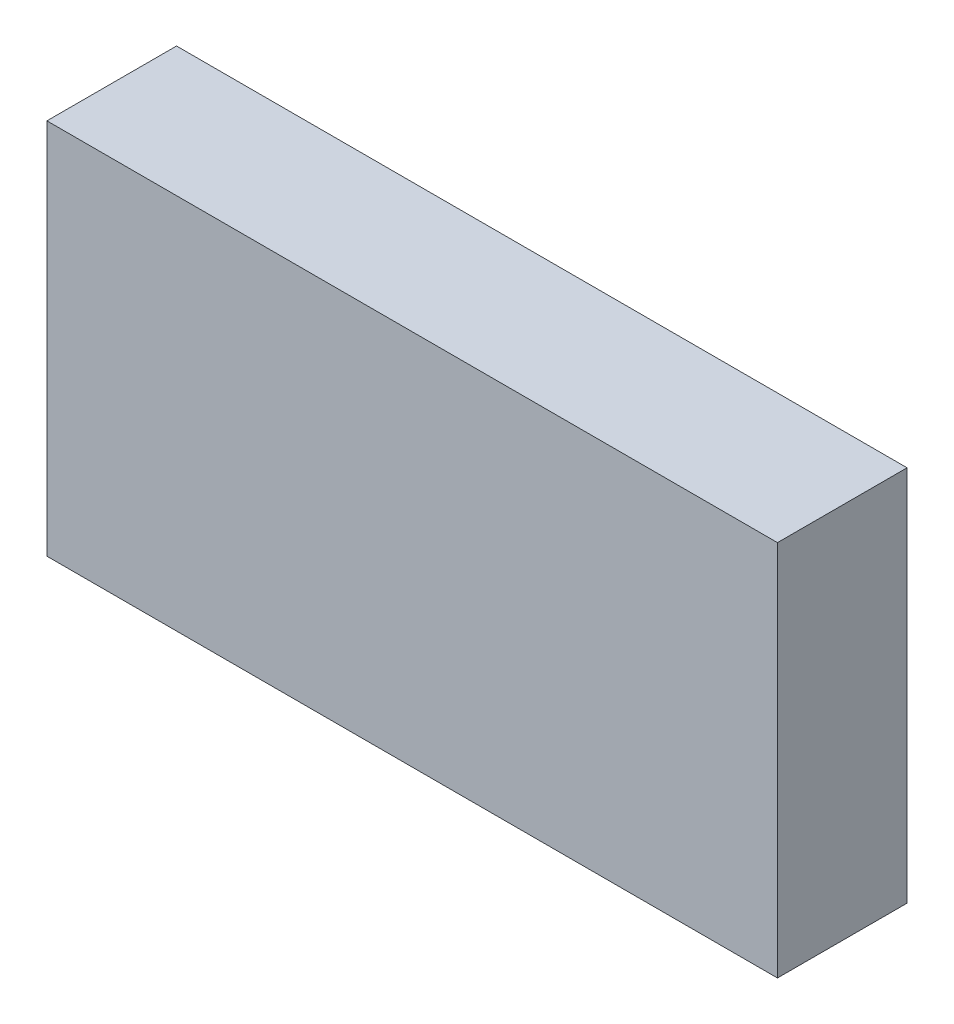
ISO-10303-21;
HEADER;
FILE_DESCRIPTION(('STEP AP214'),'2;1');
FILE_NAME('part.step','',(''),(''),'','','');
FILE_SCHEMA(('AUTOMOTIVE_DESIGN { 1 0 10303 214 1 1 1 1 }'));
ENDSEC;
DATA;
#1=APPLICATION_CONTEXT('core data for automotive mechanical design processes');
#2=APPLICATION_PROTOCOL_DEFINITION('international standard','automotive_design',2000,#1);
#3=PRODUCT_CONTEXT('',#1,'mechanical');
#4=PRODUCT('Part','Part','',(#3));
#5=PRODUCT_RELATED_PRODUCT_CATEGORY('part','',(#4));
#6=PRODUCT_DEFINITION_FORMATION('','',#4);
#7=PRODUCT_DEFINITION_CONTEXT('part definition',#1,'design');
#8=PRODUCT_DEFINITION('design','',#6,#7);
#9=PRODUCT_DEFINITION_SHAPE('','',#8);
#10=(LENGTH_UNIT() NAMED_UNIT(*) SI_UNIT(.MILLI.,.METRE.));
#11=(NAMED_UNIT(*) PLANE_ANGLE_UNIT() SI_UNIT($,.RADIAN.));
#12=(NAMED_UNIT(*) SI_UNIT($,.STERADIAN.) SOLID_ANGLE_UNIT());
#13=UNCERTAINTY_MEASURE_WITH_UNIT(LENGTH_MEASURE(1.E-05),#10,'distance_accuracy_value','');
#14=(GEOMETRIC_REPRESENTATION_CONTEXT(3) GLOBAL_UNCERTAINTY_ASSIGNED_CONTEXT((#13)) GLOBAL_UNIT_ASSIGNED_CONTEXT((#10,
#11,#12)) REPRESENTATION_CONTEXT('',''));
#15=CARTESIAN_POINT('',(0.,0.,0.));
#16=DIRECTION('',(0.,0.,1.));
#17=DIRECTION('',(1.,0.,0.));
#18=AXIS2_PLACEMENT_3D('',#15,#16,#17);
#19=CARTESIAN_POINT('',(0.,0.,0.55));
#20=DIRECTION('',(0.,0.,1.));
#21=DIRECTION('',(1.,0.,0.));
#22=AXIS2_PLACEMENT_3D('',#19,#20,#21);
#23=PLANE('',#22);
#24=DIRECTION('',(1.,0.,0.));
#25=VECTOR('',#24,1.);
#26=CARTESIAN_POINT('',(-1.55,-0.8,0.55));
#27=LINE('',#26,#25);
#28=CARTESIAN_POINT('',(1.55,-0.8,0.55));
#29=VERTEX_POINT('',#28);
#30=CARTESIAN_POINT('',(-1.55,-0.8,0.55));
#31=VERTEX_POINT('',#30);
#32=EDGE_CURVE('E58',#29,#31,#27,.F.);
#33=ORIENTED_EDGE('',*,*,#32,.F.);
#34=DIRECTION('',(0.,1.,0.));
#35=VECTOR('',#34,1.);
#36=CARTESIAN_POINT('',(1.55,-0.8,0.55));
#37=LINE('',#36,#35);
#38=CARTESIAN_POINT('',(1.55,0.8,0.55));
#39=VERTEX_POINT('',#38);
#40=EDGE_CURVE('E53',#39,#29,#37,.F.);
#41=ORIENTED_EDGE('',*,*,#40,.F.);
#42=DIRECTION('',(1.,0.,0.));
#43=VECTOR('',#42,1.);
#44=CARTESIAN_POINT('',(1.55,0.8,0.55));
#45=LINE('',#44,#43);
#46=CARTESIAN_POINT('',(-1.55,0.8,0.55));
#47=VERTEX_POINT('',#46);
#48=EDGE_CURVE('E68',#47,#39,#45,.T.);
#49=ORIENTED_EDGE('',*,*,#48,.F.);
#50=DIRECTION('',(0.,-1.,0.));
#51=VECTOR('',#50,1.);
#52=CARTESIAN_POINT('',(-1.55,0.8,0.55));
#53=LINE('',#52,#51);
#54=EDGE_CURVE('E20',#31,#47,#53,.F.);
#55=ORIENTED_EDGE('',*,*,#54,.F.);
#56=EDGE_LOOP('',(#33,#41,#49,#55));
#57=FACE_BOUND('',#56,.T.);
#58=ADVANCED_FACE('F17',(#57),#23,.T.);
#59=CARTESIAN_POINT('',(-1.55,0.8,0.));
#60=DIRECTION('',(-1.,0.,0.));
#61=DIRECTION('',(0.,-1.,0.));
#62=AXIS2_PLACEMENT_3D('',#59,#60,#61);
#63=PLANE('',#62);
#64=ORIENTED_EDGE('',*,*,#54,.T.);
#65=DIRECTION('',(0.,0.,1.));
#66=VECTOR('',#65,1.);
#67=CARTESIAN_POINT('',(-1.55,0.8,0.));
#68=LINE('',#67,#66);
#69=CARTESIAN_POINT('',(-1.55,0.8,0.));
#70=VERTEX_POINT('',#69);
#71=EDGE_CURVE('E79',#70,#47,#68,.T.);
#72=ORIENTED_EDGE('',*,*,#71,.F.);
#73=DIRECTION('',(0.,1.,0.));
#74=VECTOR('',#73,1.);
#75=CARTESIAN_POINT('',(-1.55,0.,0.));
#76=LINE('',#75,#74);
#77=CARTESIAN_POINT('',(-1.55,-0.8,0.));
#78=VERTEX_POINT('',#77);
#79=EDGE_CURVE('E74',#70,#78,#76,.F.);
#80=ORIENTED_EDGE('',*,*,#79,.T.);
#81=DIRECTION('',(0.,0.,1.));
#82=VECTOR('',#81,1.);
#83=CARTESIAN_POINT('',(-1.55,-0.8,0.));
#84=LINE('',#83,#82);
#85=EDGE_CURVE('E63',#31,#78,#84,.F.);
#86=ORIENTED_EDGE('',*,*,#85,.F.);
#87=EDGE_LOOP('',(#64,#72,#80,#86));
#88=FACE_BOUND('',#87,.T.);
#89=ADVANCED_FACE('F73',(#88),#63,.T.);
#90=CARTESIAN_POINT('',(-1.55,-0.8,0.));
#91=DIRECTION('',(0.,-1.,0.));
#92=DIRECTION('',(1.,0.,0.));
#93=AXIS2_PLACEMENT_3D('',#90,#91,#92);
#94=PLANE('',#93);
#95=ORIENTED_EDGE('',*,*,#32,.T.);
#96=ORIENTED_EDGE('',*,*,#85,.T.);
#97=DIRECTION('',(1.,0.,0.));
#98=VECTOR('',#97,1.);
#99=CARTESIAN_POINT('',(0.,-0.8,0.));
#100=LINE('',#99,#98);
#101=CARTESIAN_POINT('',(1.55,-0.8,0.));
#102=VERTEX_POINT('',#101);
#103=EDGE_CURVE('E84',#78,#102,#100,.T.);
#104=ORIENTED_EDGE('',*,*,#103,.T.);
#105=DIRECTION('',(0.,0.,1.));
#106=VECTOR('',#105,1.);
#107=CARTESIAN_POINT('',(1.55,-0.8,0.));
#108=LINE('',#107,#106);
#109=EDGE_CURVE('E65',#29,#102,#108,.F.);
#110=ORIENTED_EDGE('',*,*,#109,.F.);
#111=EDGE_LOOP('',(#95,#96,#104,#110));
#112=FACE_BOUND('',#111,.T.);
#113=ADVANCED_FACE('F60',(#112),#94,.T.);
#114=CARTESIAN_POINT('',(1.55,-0.8,0.));
#115=DIRECTION('',(1.,0.,0.));
#116=DIRECTION('',(0.,1.,0.));
#117=AXIS2_PLACEMENT_3D('',#114,#115,#116);
#118=PLANE('',#117);
#119=ORIENTED_EDGE('',*,*,#40,.T.);
#120=ORIENTED_EDGE('',*,*,#109,.T.);
#121=DIRECTION('',(0.,1.,0.));
#122=VECTOR('',#121,1.);
#123=CARTESIAN_POINT('',(1.55,0.,0.));
#124=LINE('',#123,#122);
#125=CARTESIAN_POINT('',(1.55,0.8,0.));
#126=VERTEX_POINT('',#125);
#127=EDGE_CURVE('E26',#102,#126,#124,.T.);
#128=ORIENTED_EDGE('',*,*,#127,.T.);
#129=DIRECTION('',(0.,0.,1.));
#130=VECTOR('',#129,1.);
#131=CARTESIAN_POINT('',(1.55,0.8,0.));
#132=LINE('',#131,#130);
#133=EDGE_CURVE('E34',#39,#126,#132,.F.);
#134=ORIENTED_EDGE('',*,*,#133,.F.);
#135=EDGE_LOOP('',(#119,#120,#128,#134));
#136=FACE_BOUND('',#135,.T.);
#137=ADVANCED_FACE('F88',(#136),#118,.T.);
#138=CARTESIAN_POINT('',(1.55,0.8,0.));
#139=DIRECTION('',(0.,1.,0.));
#140=DIRECTION('',(0.,0.,1.));
#141=AXIS2_PLACEMENT_3D('',#138,#139,#140);
#142=PLANE('',#141);
#143=ORIENTED_EDGE('',*,*,#48,.T.);
#144=ORIENTED_EDGE('',*,*,#133,.T.);
#145=DIRECTION('',(1.,0.,0.));
#146=VECTOR('',#145,1.);
#147=CARTESIAN_POINT('',(0.,0.8,0.));
#148=LINE('',#147,#146);
#149=EDGE_CURVE('E11',#126,#70,#148,.F.);
#150=ORIENTED_EDGE('',*,*,#149,.T.);
#151=ORIENTED_EDGE('',*,*,#71,.T.);
#152=EDGE_LOOP('',(#143,#144,#150,#151));
#153=FACE_BOUND('',#152,.T.);
#154=ADVANCED_FACE('F91',(#153),#142,.T.);
#155=CARTESIAN_POINT('',(0.,0.,0.));
#156=DIRECTION('',(0.,0.,1.));
#157=DIRECTION('',(1.,0.,0.));
#158=AXIS2_PLACEMENT_3D('',#155,#156,#157);
#159=PLANE('',#158);
#160=ORIENTED_EDGE('',*,*,#127,.F.);
#161=ORIENTED_EDGE('',*,*,#103,.F.);
#162=ORIENTED_EDGE('',*,*,#79,.F.);
#163=ORIENTED_EDGE('',*,*,#149,.F.);
#164=EDGE_LOOP('',(#160,#161,#162,#163));
#165=FACE_BOUND('',#164,.T.);
#166=ADVANCED_FACE('F90',(#165),#159,.F.);
#167=CLOSED_SHELL('',(#58,#89,#113,#137,#154,#166));
#168=MANIFOLD_SOLID_BREP('B1',#167);
#169=ADVANCED_BREP_SHAPE_REPRESENTATION('',(#18,#168),#14);
#170=SHAPE_DEFINITION_REPRESENTATION(#9,#169);
ENDSEC;
END-ISO-10303-21;
